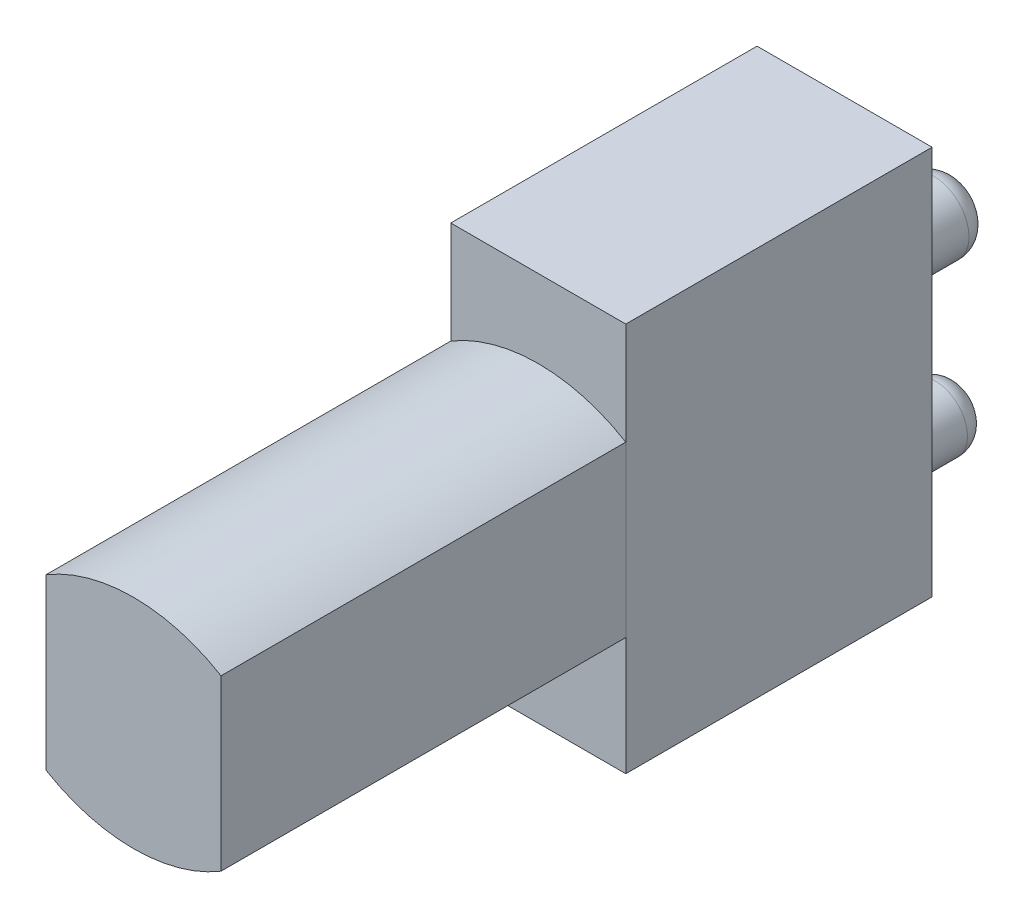
ISO-10303-21;
HEADER;
FILE_DESCRIPTION(('STEP AP214'),'2;1');
FILE_NAME('part.step','',(''),(''),'','','');
FILE_SCHEMA(('AUTOMOTIVE_DESIGN { 1 0 10303 214 1 1 1 1 }'));
ENDSEC;
DATA;
#1=APPLICATION_CONTEXT('core data for automotive mechanical design processes');
#2=APPLICATION_PROTOCOL_DEFINITION('international standard','automotive_design',2000,#1);
#3=PRODUCT_CONTEXT('',#1,'mechanical');
#4=PRODUCT('Part','Part','',(#3));
#5=PRODUCT_RELATED_PRODUCT_CATEGORY('part','',(#4));
#6=PRODUCT_DEFINITION_FORMATION('','',#4);
#7=PRODUCT_DEFINITION_CONTEXT('part definition',#1,'design');
#8=PRODUCT_DEFINITION('design','',#6,#7);
#9=PRODUCT_DEFINITION_SHAPE('','',#8);
#10=(LENGTH_UNIT() NAMED_UNIT(*) SI_UNIT(.MILLI.,.METRE.));
#11=(NAMED_UNIT(*) PLANE_ANGLE_UNIT() SI_UNIT($,.RADIAN.));
#12=(NAMED_UNIT(*) SI_UNIT($,.STERADIAN.) SOLID_ANGLE_UNIT());
#13=UNCERTAINTY_MEASURE_WITH_UNIT(LENGTH_MEASURE(1.E-05),#10,'distance_accuracy_value','');
#14=(GEOMETRIC_REPRESENTATION_CONTEXT(3) GLOBAL_UNCERTAINTY_ASSIGNED_CONTEXT((#13)) GLOBAL_UNIT_ASSIGNED_CONTEXT((#10,
#11,#12)) REPRESENTATION_CONTEXT('',''));
#15=CARTESIAN_POINT('',(0.,0.,0.));
#16=DIRECTION('',(0.,0.,1.));
#17=DIRECTION('',(1.,0.,0.));
#18=AXIS2_PLACEMENT_3D('',#15,#16,#17);
#19=CARTESIAN_POINT('',(-4.00175410508339,2.78514812405181,32.5));
#20=DIRECTION('',(0.,0.,-1.));
#21=DIRECTION('',(-1.,0.,0.));
#22=AXIS2_PLACEMENT_3D('',#19,#20,#21);
#23=CYLINDRICAL_SURFACE('',#22,7.76228535152648);
#24=CARTESIAN_POINT('',(-4.00175410508339,2.78514812405181,14.));
#25=DIRECTION('',(0.,0.,1.));
#26=DIRECTION('',(-1.,0.,0.));
#27=AXIS2_PLACEMENT_3D('',#24,#25,#26);
#28=CIRCLE('',#27,7.76228535152648);
#29=CARTESIAN_POINT('',(-8.00175410508339,-3.86715026661908,14.));
#30=VERTEX_POINT('',#29);
#31=CARTESIAN_POINT('',(-0.00175410508338608,-3.86715026661908,14.));
#32=VERTEX_POINT('',#31);
#33=EDGE_CURVE('E109',#30,#32,#28,.T.);
#34=ORIENTED_EDGE('',*,*,#33,.T.);
#35=DIRECTION('',(0.,0.,-1.));
#36=VECTOR('',#35,1.);
#37=CARTESIAN_POINT('',(-0.00175410508338608,-3.86715026661908,32.5));
#38=LINE('',#37,#36);
#39=CARTESIAN_POINT('',(-0.00175410508338608,-3.86715026661908,32.5));
#40=VERTEX_POINT('',#39);
#41=EDGE_CURVE('E12',#40,#32,#38,.T.);
#42=ORIENTED_EDGE('',*,*,#41,.F.);
#43=CARTESIAN_POINT('',(-4.00175410508339,2.78514812405181,32.5));
#44=DIRECTION('',(0.,0.,1.));
#45=DIRECTION('',(-1.,0.,0.));
#46=AXIS2_PLACEMENT_3D('',#43,#44,#45);
#47=CIRCLE('',#46,7.76228535152648);
#48=CARTESIAN_POINT('',(-8.00175410508339,-3.86715026661908,32.5));
#49=VERTEX_POINT('',#48);
#50=EDGE_CURVE('E97',#49,#40,#47,.T.);
#51=ORIENTED_EDGE('',*,*,#50,.F.);
#52=DIRECTION('',(0.,0.,-1.));
#53=VECTOR('',#52,1.);
#54=CARTESIAN_POINT('',(-8.00175410508339,-3.86715026661908,32.5));
#55=LINE('',#54,#53);
#56=EDGE_CURVE('E105',#49,#30,#55,.T.);
#57=ORIENTED_EDGE('',*,*,#56,.T.);
#58=EDGE_LOOP('',(#34,#42,#51,#57));
#59=FACE_BOUND('',#58,.T.);
#60=ADVANCED_FACE('F46',(#59),#23,.T.);
#61=CARTESIAN_POINT('',(-0.00175410508338608,-3.86715026661908,32.5));
#62=DIRECTION('',(-1.,0.,0.));
#63=DIRECTION('',(0.,0.,1.));
#64=AXIS2_PLACEMENT_3D('',#61,#62,#63);
#65=PLANE('',#64);
#66=DIRECTION('',(0.,1.,0.));
#67=VECTOR('',#66,1.);
#68=CARTESIAN_POINT('',(-0.00175410508338608,-3.86715026661908,14.));
#69=LINE('',#68,#67);
#70=CARTESIAN_POINT('',(-0.00175410508338608,3.86715026661908,14.));
#71=VERTEX_POINT('',#70);
#72=EDGE_CURVE('E101',#32,#71,#69,.T.);
#73=ORIENTED_EDGE('',*,*,#72,.T.);
#74=DIRECTION('',(0.,0.,-1.));
#75=VECTOR('',#74,1.);
#76=CARTESIAN_POINT('',(-0.00175410508338608,3.86715026661908,32.5));
#77=LINE('',#76,#75);
#78=CARTESIAN_POINT('',(-0.00175410508338608,3.86715026661908,32.5));
#79=VERTEX_POINT('',#78);
#80=EDGE_CURVE('E54',#79,#71,#77,.T.);
#81=ORIENTED_EDGE('',*,*,#80,.F.);
#82=DIRECTION('',(0.,1.,0.));
#83=VECTOR('',#82,1.);
#84=CARTESIAN_POINT('',(-0.00175410508338608,-3.86715026661908,32.5));
#85=LINE('',#84,#83);
#86=EDGE_CURVE('E92',#40,#79,#85,.T.);
#87=ORIENTED_EDGE('',*,*,#86,.F.);
#88=ORIENTED_EDGE('',*,*,#41,.T.);
#89=EDGE_LOOP('',(#73,#81,#87,#88));
#90=FACE_BOUND('',#89,.T.);
#91=ADVANCED_FACE('F100',(#90),#65,.F.);
#92=CARTESIAN_POINT('',(-4.00175410508339,-2.78514812405181,32.5));
#93=DIRECTION('',(0.,0.,-1.));
#94=DIRECTION('',(-1.,0.,0.));
#95=AXIS2_PLACEMENT_3D('',#92,#93,#94);
#96=CYLINDRICAL_SURFACE('',#95,7.76228535152648);
#97=CARTESIAN_POINT('',(-4.00175410508339,-2.78514812405181,14.));
#98=DIRECTION('',(0.,0.,1.));
#99=DIRECTION('',(1.,0.,0.));
#100=AXIS2_PLACEMENT_3D('',#97,#98,#99);
#101=CIRCLE('',#100,7.76228535152648);
#102=CARTESIAN_POINT('',(-8.00175410508339,3.86715026661908,14.));
#103=VERTEX_POINT('',#102);
#104=EDGE_CURVE('E79',#71,#103,#101,.T.);
#105=ORIENTED_EDGE('',*,*,#104,.T.);
#106=DIRECTION('',(0.,0.,-1.));
#107=VECTOR('',#106,1.);
#108=CARTESIAN_POINT('',(-8.00175410508339,3.86715026661908,32.5));
#109=LINE('',#108,#107);
#110=CARTESIAN_POINT('',(-8.00175410508339,3.86715026661908,32.5));
#111=VERTEX_POINT('',#110);
#112=EDGE_CURVE('E102',#111,#103,#109,.T.);
#113=ORIENTED_EDGE('',*,*,#112,.F.);
#114=CARTESIAN_POINT('',(-4.00175410508339,-2.78514812405181,32.5));
#115=DIRECTION('',(0.,0.,1.));
#116=DIRECTION('',(1.,0.,0.));
#117=AXIS2_PLACEMENT_3D('',#114,#115,#116);
#118=CIRCLE('',#117,7.76228535152648);
#119=EDGE_CURVE('E95',#79,#111,#118,.T.);
#120=ORIENTED_EDGE('',*,*,#119,.F.);
#121=ORIENTED_EDGE('',*,*,#80,.T.);
#122=EDGE_LOOP('',(#105,#113,#120,#121));
#123=FACE_BOUND('',#122,.T.);
#124=ADVANCED_FACE('F103',(#123),#96,.T.);
#125=CARTESIAN_POINT('',(-8.00175410508339,-3.86715026661908,32.5));
#126=DIRECTION('',(1.,0.,0.));
#127=DIRECTION('',(0.,0.,-1.));
#128=AXIS2_PLACEMENT_3D('',#125,#126,#127);
#129=PLANE('',#128);
#130=DIRECTION('',(0.,-1.,0.));
#131=VECTOR('',#130,1.);
#132=CARTESIAN_POINT('',(-8.00175410508339,-3.86715026661908,14.));
#133=LINE('',#132,#131);
#134=EDGE_CURVE('E85',#103,#30,#133,.T.);
#135=ORIENTED_EDGE('',*,*,#134,.T.);
#136=ORIENTED_EDGE('',*,*,#56,.F.);
#137=DIRECTION('',(0.,-1.,0.));
#138=VECTOR('',#137,1.);
#139=CARTESIAN_POINT('',(-8.00175410508339,-3.86715026661908,32.5));
#140=LINE('',#139,#138);
#141=EDGE_CURVE('E62',#111,#49,#140,.T.);
#142=ORIENTED_EDGE('',*,*,#141,.F.);
#143=ORIENTED_EDGE('',*,*,#112,.T.);
#144=EDGE_LOOP('',(#135,#136,#142,#143));
#145=FACE_BOUND('',#144,.T.);
#146=ADVANCED_FACE('F116',(#145),#129,.F.);
#147=CARTESIAN_POINT('',(-4.00175410508339,2.78514812405181,32.5));
#148=DIRECTION('',(0.,0.,-1.));
#149=DIRECTION('',(-1.,0.,0.));
#150=AXIS2_PLACEMENT_3D('',#147,#148,#149);
#151=PLANE('',#150);
#152=ORIENTED_EDGE('',*,*,#50,.T.);
#153=ORIENTED_EDGE('',*,*,#86,.T.);
#154=ORIENTED_EDGE('',*,*,#119,.T.);
#155=ORIENTED_EDGE('',*,*,#141,.T.);
#156=EDGE_LOOP('',(#152,#153,#154,#155));
#157=FACE_BOUND('',#156,.T.);
#158=ADVANCED_FACE('F93',(#157),#151,.F.);
#159=CARTESIAN_POINT('',(-4.00175410508339,2.78514812405181,14.));
#160=DIRECTION('',(0.,0.,-1.));
#161=DIRECTION('',(-1.,0.,0.));
#162=AXIS2_PLACEMENT_3D('',#159,#160,#161);
#163=PLANE('',#162);
#164=ORIENTED_EDGE('',*,*,#33,.F.);
#165=ORIENTED_EDGE('',*,*,#134,.F.);
#166=ORIENTED_EDGE('',*,*,#104,.F.);
#167=ORIENTED_EDGE('',*,*,#72,.F.);
#168=EDGE_LOOP('',(#164,#165,#166,#167));
#169=FACE_BOUND('',#168,.T.);
#170=ADVANCED_FACE('F119',(#169),#163,.T.);
#171=CLOSED_SHELL('',(#60,#91,#124,#146,#158,#170));
#172=MANIFOLD_SOLID_BREP('B2',#171);
#173=CARTESIAN_POINT('',(-8.00175410508339,-9.25917260731079,14.));
#174=DIRECTION('',(1.,0.,0.));
#175=DIRECTION('',(0.,0.,-1.));
#176=AXIS2_PLACEMENT_3D('',#173,#174,#175);
#177=PLANE('',#176);
#178=DIRECTION('',(0.,-1.,0.));
#179=VECTOR('',#178,1.);
#180=CARTESIAN_POINT('',(-8.00175410508339,-9.25917260731079,0.));
#181=LINE('',#180,#179);
#182=CARTESIAN_POINT('',(-8.00175410508339,8.54082739268921,0.));
#183=VERTEX_POINT('',#182);
#184=CARTESIAN_POINT('',(-8.00175410508339,-9.25917260731079,0.));
#185=VERTEX_POINT('',#184);
#186=EDGE_CURVE('E239',#183,#185,#181,.T.);
#187=ORIENTED_EDGE('',*,*,#186,.T.);
#188=DIRECTION('',(0.,0.,-1.));
#189=VECTOR('',#188,1.);
#190=CARTESIAN_POINT('',(-8.00175410508339,-9.25917260731079,14.));
#191=LINE('',#190,#189);
#192=CARTESIAN_POINT('',(-8.00175410508339,-9.25917260731079,14.));
#193=VERTEX_POINT('',#192);
#194=EDGE_CURVE('E230',#193,#185,#191,.T.);
#195=ORIENTED_EDGE('',*,*,#194,.F.);
#196=DIRECTION('',(0.,-1.,0.));
#197=VECTOR('',#196,1.);
#198=CARTESIAN_POINT('',(-8.00175410508339,-9.25917260731079,14.));
#199=LINE('',#198,#197);
#200=CARTESIAN_POINT('',(-8.00175410508339,8.54082739268921,14.));
#201=VERTEX_POINT('',#200);
#202=EDGE_CURVE('E224',#201,#193,#199,.T.);
#203=ORIENTED_EDGE('',*,*,#202,.F.);
#204=DIRECTION('',(0.,0.,-1.));
#205=VECTOR('',#204,1.);
#206=CARTESIAN_POINT('',(-8.00175410508339,8.54082739268921,14.));
#207=LINE('',#206,#205);
#208=EDGE_CURVE('E235',#201,#183,#207,.T.);
#209=ORIENTED_EDGE('',*,*,#208,.T.);
#210=EDGE_LOOP('',(#187,#195,#203,#209));
#211=FACE_BOUND('',#210,.T.);
#212=ADVANCED_FACE('F171',(#211),#177,.F.);
#213=CARTESIAN_POINT('',(-8.00175410508339,-9.25917260731079,14.));
#214=DIRECTION('',(0.,1.,0.));
#215=DIRECTION('',(0.,0.,1.));
#216=AXIS2_PLACEMENT_3D('',#213,#214,#215);
#217=PLANE('',#216);
#218=DIRECTION('',(1.,0.,0.));
#219=VECTOR('',#218,1.);
#220=CARTESIAN_POINT('',(-8.00175410508339,-9.25917260731079,0.));
#221=LINE('',#220,#219);
#222=CARTESIAN_POINT('',(-0.00175410508338608,-9.25917260731079,0.));
#223=VERTEX_POINT('',#222);
#224=EDGE_CURVE('E229',#185,#223,#221,.T.);
#225=ORIENTED_EDGE('',*,*,#224,.T.);
#226=DIRECTION('',(0.,0.,-1.));
#227=VECTOR('',#226,1.);
#228=CARTESIAN_POINT('',(-0.00175410508338608,-9.25917260731079,14.));
#229=LINE('',#228,#227);
#230=CARTESIAN_POINT('',(-0.00175410508338608,-9.25917260731079,14.));
#231=VERTEX_POINT('',#230);
#232=EDGE_CURVE('E227',#231,#223,#229,.T.);
#233=ORIENTED_EDGE('',*,*,#232,.F.);
#234=DIRECTION('',(1.,0.,0.));
#235=VECTOR('',#234,1.);
#236=CARTESIAN_POINT('',(-8.00175410508339,-9.25917260731079,14.));
#237=LINE('',#236,#235);
#238=EDGE_CURVE('E219',#193,#231,#237,.T.);
#239=ORIENTED_EDGE('',*,*,#238,.F.);
#240=ORIENTED_EDGE('',*,*,#194,.T.);
#241=EDGE_LOOP('',(#225,#233,#239,#240));
#242=FACE_BOUND('',#241,.T.);
#243=ADVANCED_FACE('F228',(#242),#217,.F.);
#244=CARTESIAN_POINT('',(-0.00175410508338608,-9.25917260731079,14.));
#245=DIRECTION('',(-1.,0.,0.));
#246=DIRECTION('',(0.,0.,1.));
#247=AXIS2_PLACEMENT_3D('',#244,#245,#246);
#248=PLANE('',#247);
#249=DIRECTION('',(0.,1.,0.));
#250=VECTOR('',#249,1.);
#251=CARTESIAN_POINT('',(-0.00175410508338608,-9.25917260731079,0.));
#252=LINE('',#251,#250);
#253=CARTESIAN_POINT('',(-0.00175410508338608,8.54082739268921,0.));
#254=VERTEX_POINT('',#253);
#255=EDGE_CURVE('E205',#223,#254,#252,.T.);
#256=ORIENTED_EDGE('',*,*,#255,.T.);
#257=DIRECTION('',(0.,0.,-1.));
#258=VECTOR('',#257,1.);
#259=CARTESIAN_POINT('',(-0.00175410508338608,8.54082739268921,14.));
#260=LINE('',#259,#258);
#261=CARTESIAN_POINT('',(-0.00175410508338608,8.54082739268921,14.));
#262=VERTEX_POINT('',#261);
#263=EDGE_CURVE('E231',#262,#254,#260,.T.);
#264=ORIENTED_EDGE('',*,*,#263,.F.);
#265=DIRECTION('',(0.,1.,0.));
#266=VECTOR('',#265,1.);
#267=CARTESIAN_POINT('',(-0.00175410508338608,-9.25917260731079,14.));
#268=LINE('',#267,#266);
#269=EDGE_CURVE('E222',#231,#262,#268,.T.);
#270=ORIENTED_EDGE('',*,*,#269,.F.);
#271=ORIENTED_EDGE('',*,*,#232,.T.);
#272=EDGE_LOOP('',(#256,#264,#270,#271));
#273=FACE_BOUND('',#272,.T.);
#274=ADVANCED_FACE('F233',(#273),#248,.F.);
#275=CARTESIAN_POINT('',(-8.00175410508339,8.54082739268921,14.));
#276=DIRECTION('',(0.,-1.,0.));
#277=DIRECTION('',(0.,0.,-1.));
#278=AXIS2_PLACEMENT_3D('',#275,#276,#277);
#279=PLANE('',#278);
#280=DIRECTION('',(-1.,0.,0.));
#281=VECTOR('',#280,1.);
#282=CARTESIAN_POINT('',(-8.00175410508339,8.54082739268921,0.));
#283=LINE('',#282,#281);
#284=EDGE_CURVE('E211',#254,#183,#283,.T.);
#285=ORIENTED_EDGE('',*,*,#284,.T.);
#286=ORIENTED_EDGE('',*,*,#208,.F.);
#287=DIRECTION('',(-1.,0.,0.));
#288=VECTOR('',#287,1.);
#289=CARTESIAN_POINT('',(-8.00175410508339,8.54082739268921,14.));
#290=LINE('',#289,#288);
#291=EDGE_CURVE('E188',#262,#201,#290,.T.);
#292=ORIENTED_EDGE('',*,*,#291,.F.);
#293=ORIENTED_EDGE('',*,*,#263,.T.);
#294=EDGE_LOOP('',(#285,#286,#292,#293));
#295=FACE_BOUND('',#294,.T.);
#296=ADVANCED_FACE('F297',(#295),#279,.F.);
#297=CARTESIAN_POINT('',(0.,0.,14.));
#298=DIRECTION('',(0.,0.,-1.));
#299=DIRECTION('',(-1.,0.,0.));
#300=AXIS2_PLACEMENT_3D('',#297,#298,#299);
#301=PLANE('',#300);
#302=ORIENTED_EDGE('',*,*,#202,.T.);
#303=ORIENTED_EDGE('',*,*,#238,.T.);
#304=ORIENTED_EDGE('',*,*,#269,.T.);
#305=ORIENTED_EDGE('',*,*,#291,.T.);
#306=EDGE_LOOP('',(#302,#303,#304,#305));
#307=FACE_BOUND('',#306,.T.);
#308=ADVANCED_FACE('F220',(#307),#301,.F.);
#309=CARTESIAN_POINT('',(0.,0.,0.));
#310=DIRECTION('',(0.,0.,-1.));
#311=DIRECTION('',(-1.,0.,0.));
#312=AXIS2_PLACEMENT_3D('',#309,#310,#311);
#313=PLANE('',#312);
#314=CARTESIAN_POINT('',(-4.00175410508339,1.7472981068621,0.));
#315=DIRECTION('',(0.,0.,-1.));
#316=DIRECTION('',(-1.,0.,0.));
#317=AXIS2_PLACEMENT_3D('',#314,#315,#316);
#318=CIRCLE('',#317,1.6);
#319=CARTESIAN_POINT('',(-5.60175410508339,1.7472981068621,0.));
#320=VERTEX_POINT('',#319);
#321=EDGE_CURVE('E268',#320,#320,#318,.T.);
#322=ORIENTED_EDGE('',*,*,#321,.F.);
#323=EDGE_LOOP('',(#322));
#324=FACE_BOUND('',#323,.T.);
#325=CARTESIAN_POINT('',(-4.00175410508339,-6.25552786999559,0.));
#326=DIRECTION('',(0.,0.,-1.));
#327=DIRECTION('',(-1.,0.,0.));
#328=AXIS2_PLACEMENT_3D('',#325,#326,#327);
#329=CIRCLE('',#328,1.45511243380002);
#330=CARTESIAN_POINT('',(-5.45686653888341,-6.25552786999559,0.));
#331=VERTEX_POINT('',#330);
#332=EDGE_CURVE('E242',#331,#331,#329,.T.);
#333=ORIENTED_EDGE('',*,*,#332,.F.);
#334=EDGE_LOOP('',(#333));
#335=FACE_BOUND('',#334,.T.);
#336=ORIENTED_EDGE('',*,*,#186,.F.);
#337=ORIENTED_EDGE('',*,*,#284,.F.);
#338=ORIENTED_EDGE('',*,*,#255,.F.);
#339=ORIENTED_EDGE('',*,*,#224,.F.);
#340=EDGE_LOOP('',(#336,#337,#338,#339));
#341=FACE_BOUND('',#340,.T.);
#342=ADVANCED_FACE('F300',(#324,#335,#341),#313,.T.);
#343=CARTESIAN_POINT('',(-4.00175410508339,-6.25552786999559,-5.));
#344=DIRECTION('',(0.,0.,1.));
#345=DIRECTION('',(1.,0.,0.));
#346=AXIS2_PLACEMENT_3D('',#343,#344,#345);
#347=CYLINDRICAL_SURFACE('',#346,1.45511243380002);
#348=CARTESIAN_POINT('',(-4.00175410508339,-6.25552786999559,-4.15977437014816));
#349=DIRECTION('',(0.,0.,-1.));
#350=DIRECTION('',(-1.,0.,0.));
#351=AXIS2_PLACEMENT_3D('',#348,#349,#350);
#352=CIRCLE('',#351,1.45511243380002);
#353=CARTESIAN_POINT('',(-5.45686653888341,-6.25552786999559,-4.15977437014816));
#354=VERTEX_POINT('',#353);
#355=EDGE_CURVE('E180',#354,#354,#352,.F.);
#356=ORIENTED_EDGE('',*,*,#355,.T.);
#357=EDGE_LOOP('',(#356));
#358=FACE_BOUND('',#357,.T.);
#359=ORIENTED_EDGE('',*,*,#332,.T.);
#360=EDGE_LOOP('',(#359));
#361=FACE_BOUND('',#360,.T.);
#362=ADVANCED_FACE('F257',(#358,#361),#347,.T.);
#363=CARTESIAN_POINT('',(-4.00175410508339,-6.25552786999559,-5.));
#364=DIRECTION('',(0.,0.,1.));
#365=DIRECTION('',(1.,0.,0.));
#366=AXIS2_PLACEMENT_3D('',#363,#364,#365);
#367=CYLINDRICAL_SURFACE('',#366,0.997349366275192);
#368=CARTESIAN_POINT('',(-4.00175410508339,-6.25552786999559,-5.));
#369=DIRECTION('',(0.,0.,-1.));
#370=DIRECTION('',(-1.,0.,0.));
#371=AXIS2_PLACEMENT_3D('',#368,#369,#370);
#372=CIRCLE('',#371,0.997349366275192);
#373=CARTESIAN_POINT('',(-4.99910347135858,-6.25552786999559,-5.));
#374=VERTEX_POINT('',#373);
#375=EDGE_CURVE('E266',#374,#374,#372,.T.);
#376=ORIENTED_EDGE('',*,*,#375,.T.);
#377=EDGE_LOOP('',(#376));
#378=FACE_BOUND('',#377,.T.);
#379=CARTESIAN_POINT('',(-4.00175410508339,-6.25552786999559,0.));
#380=DIRECTION('',(0.,0.,-1.));
#381=DIRECTION('',(-1.,0.,0.));
#382=AXIS2_PLACEMENT_3D('',#379,#380,#381);
#383=CIRCLE('',#382,0.997349366275192);
#384=CARTESIAN_POINT('',(-4.99910347135858,-6.25552786999559,0.));
#385=VERTEX_POINT('',#384);
#386=EDGE_CURVE('E249',#385,#385,#383,.F.);
#387=ORIENTED_EDGE('',*,*,#386,.T.);
#388=EDGE_LOOP('',(#387));
#389=FACE_BOUND('',#388,.T.);
#390=ADVANCED_FACE('F309',(#378,#389),#367,.F.);
#391=ORIENTED_EDGE('',*,*,#386,.F.);
#392=EDGE_LOOP('',(#391));
#393=FACE_BOUND('',#392,.T.);
#394=ADVANCED_FACE('F304',(#393),#313,.T.);
#395=CARTESIAN_POINT('',(-4.00175410508339,1.7472981068621,-5.));
#396=DIRECTION('',(0.,0.,1.));
#397=DIRECTION('',(1.,0.,0.));
#398=AXIS2_PLACEMENT_3D('',#395,#396,#397);
#399=CYLINDRICAL_SURFACE('',#398,1.6);
#400=CARTESIAN_POINT('',(-4.00175410508339,1.7472981068621,-4.08484251303062));
#401=DIRECTION('',(0.,0.,-1.));
#402=DIRECTION('',(-1.,0.,0.));
#403=AXIS2_PLACEMENT_3D('',#400,#401,#402);
#404=CIRCLE('',#403,1.6);
#405=CARTESIAN_POINT('',(-5.60175410508339,1.7472981068621,-4.08484251303062));
#406=VERTEX_POINT('',#405);
#407=EDGE_CURVE('E44',#406,#406,#404,.F.);
#408=ORIENTED_EDGE('',*,*,#407,.T.);
#409=EDGE_LOOP('',(#408));
#410=FACE_BOUND('',#409,.T.);
#411=ORIENTED_EDGE('',*,*,#321,.T.);
#412=EDGE_LOOP('',(#411));
#413=FACE_BOUND('',#412,.T.);
#414=ADVANCED_FACE('F312',(#410,#413),#399,.T.);
#415=CARTESIAN_POINT('',(-4.00175410508339,1.7472981068621,-5.));
#416=DIRECTION('',(0.,0.,1.));
#417=DIRECTION('',(1.,0.,0.));
#418=AXIS2_PLACEMENT_3D('',#415,#416,#417);
#419=CYLINDRICAL_SURFACE('',#418,1.00309648230155);
#420=CARTESIAN_POINT('',(-4.00175410508339,1.7472981068621,-5.));
#421=DIRECTION('',(0.,0.,-1.));
#422=DIRECTION('',(-1.,0.,0.));
#423=AXIS2_PLACEMENT_3D('',#420,#421,#422);
#424=CIRCLE('',#423,1.00309648230155);
#425=CARTESIAN_POINT('',(-5.00485058738493,1.7472981068621,-5.));
#426=VERTEX_POINT('',#425);
#427=EDGE_CURVE('E273',#426,#426,#424,.T.);
#428=ORIENTED_EDGE('',*,*,#427,.T.);
#429=EDGE_LOOP('',(#428));
#430=FACE_BOUND('',#429,.T.);
#431=CARTESIAN_POINT('',(-4.00175410508339,1.7472981068621,0.));
#432=DIRECTION('',(0.,0.,-1.));
#433=DIRECTION('',(-1.,0.,0.));
#434=AXIS2_PLACEMENT_3D('',#431,#432,#433);
#435=CIRCLE('',#434,1.00309648230155);
#436=CARTESIAN_POINT('',(-5.00485058738493,1.7472981068621,0.));
#437=VERTEX_POINT('',#436);
#438=EDGE_CURVE('E252',#437,#437,#435,.F.);
#439=ORIENTED_EDGE('',*,*,#438,.T.);
#440=EDGE_LOOP('',(#439));
#441=FACE_BOUND('',#440,.T.);
#442=ADVANCED_FACE('F279',(#430,#441),#419,.F.);
#443=ORIENTED_EDGE('',*,*,#438,.F.);
#444=EDGE_LOOP('',(#443));
#445=FACE_BOUND('',#444,.T.);
#446=ADVANCED_FACE('F263',(#445),#313,.T.);
#447=CARTESIAN_POINT('',(-4.00175410508339,-6.25552786999559,-4.15977437014816));
#448=DIRECTION('',(0.,0.,-1.));
#449=DIRECTION('',(-1.,0.,0.));
#450=AXIS2_PLACEMENT_3D('',#447,#448,#449);
#451=DEGENERATE_TOROIDAL_SURFACE('',#450,0.455112433800019,1.,.T.);
#452=ORIENTED_EDGE('',*,*,#355,.F.);
#453=EDGE_LOOP('',(#452));
#454=FACE_BOUND('',#453,.T.);
#455=ORIENTED_EDGE('',*,*,#375,.F.);
#456=EDGE_LOOP('',(#455));
#457=FACE_BOUND('',#456,.T.);
#458=ADVANCED_FACE('F260',(#454,#457),#451,.T.);
#459=CARTESIAN_POINT('',(-4.00175410508339,1.7472981068621,-4.08484251303062));
#460=DIRECTION('',(0.,0.,-1.));
#461=DIRECTION('',(-1.,0.,0.));
#462=AXIS2_PLACEMENT_3D('',#459,#460,#461);
#463=DEGENERATE_TOROIDAL_SURFACE('',#462,0.6,1.,.T.);
#464=ORIENTED_EDGE('',*,*,#407,.F.);
#465=EDGE_LOOP('',(#464));
#466=FACE_BOUND('',#465,.T.);
#467=ORIENTED_EDGE('',*,*,#427,.F.);
#468=EDGE_LOOP('',(#467));
#469=FACE_BOUND('',#468,.T.);
#470=ADVANCED_FACE('F173',(#466,#469),#463,.T.);
#471=CLOSED_SHELL('',(#212,#243,#274,#296,#308,#342,#362,#390,#394,#414,#442,#446,#458,#470));
#472=MANIFOLD_SOLID_BREP('B6',#471);
#473=ADVANCED_BREP_SHAPE_REPRESENTATION('',(#18,#172,#472),#14);
#474=SHAPE_DEFINITION_REPRESENTATION(#9,#473);
ENDSEC;
END-ISO-10303-21;
